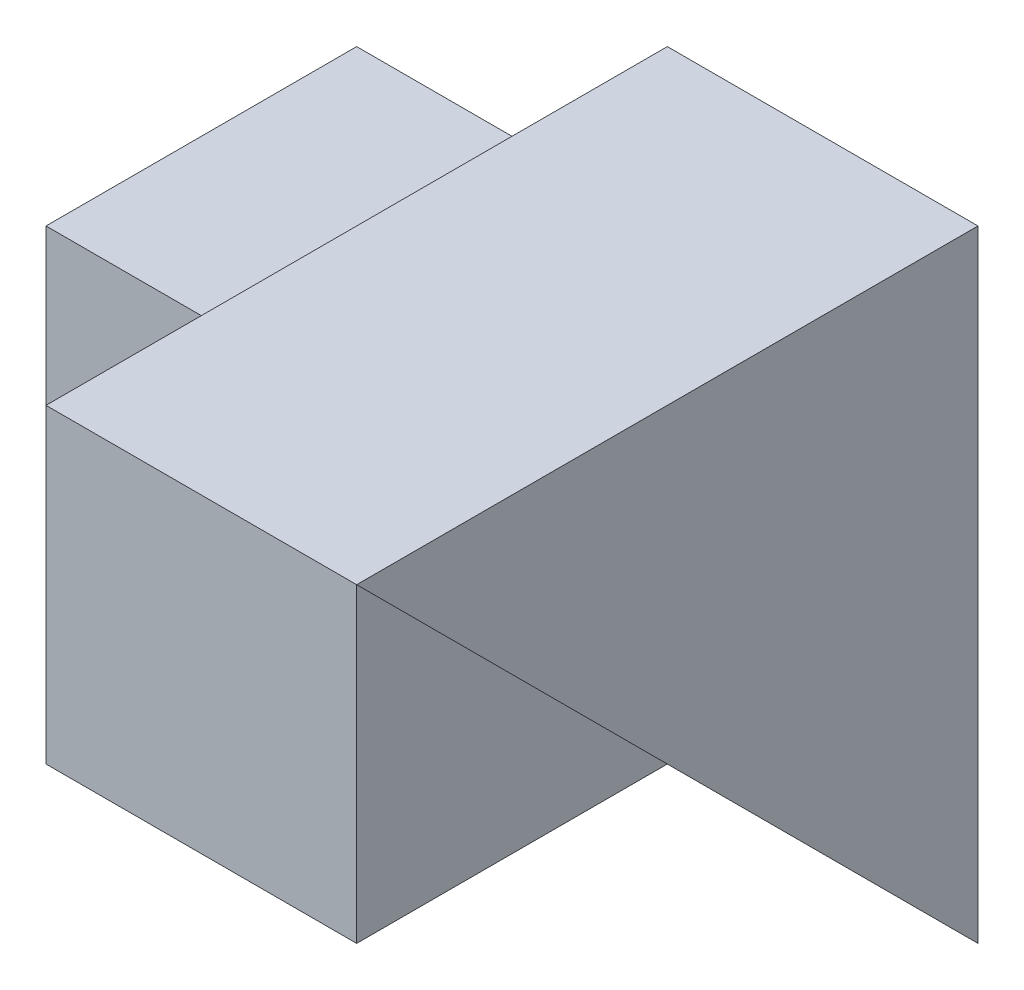
ISO-10303-21;
HEADER;
FILE_DESCRIPTION(('STEP AP214'),'2;1');
FILE_NAME('part.step','',(''),(''),'','','');
FILE_SCHEMA(('AUTOMOTIVE_DESIGN { 1 0 10303 214 1 1 1 1 }'));
ENDSEC;
DATA;
#1=APPLICATION_CONTEXT('core data for automotive mechanical design processes');
#2=APPLICATION_PROTOCOL_DEFINITION('international standard','automotive_design',2000,#1);
#3=PRODUCT_CONTEXT('',#1,'mechanical');
#4=PRODUCT('Part','Part','',(#3));
#5=PRODUCT_RELATED_PRODUCT_CATEGORY('part','',(#4));
#6=PRODUCT_DEFINITION_FORMATION('','',#4);
#7=PRODUCT_DEFINITION_CONTEXT('part definition',#1,'design');
#8=PRODUCT_DEFINITION('design','',#6,#7);
#9=PRODUCT_DEFINITION_SHAPE('','',#8);
#10=(LENGTH_UNIT() NAMED_UNIT(*) SI_UNIT(.MILLI.,.METRE.));
#11=(NAMED_UNIT(*) PLANE_ANGLE_UNIT() SI_UNIT($,.RADIAN.));
#12=(NAMED_UNIT(*) SI_UNIT($,.STERADIAN.) SOLID_ANGLE_UNIT());
#13=UNCERTAINTY_MEASURE_WITH_UNIT(LENGTH_MEASURE(1.E-05),#10,'distance_accuracy_value','');
#14=(GEOMETRIC_REPRESENTATION_CONTEXT(3) GLOBAL_UNCERTAINTY_ASSIGNED_CONTEXT((#13)) GLOBAL_UNIT_ASSIGNED_CONTEXT((#10,
#11,#12)) REPRESENTATION_CONTEXT('',''));
#15=CARTESIAN_POINT('',(0.,0.,0.));
#16=DIRECTION('',(0.,0.,1.));
#17=DIRECTION('',(1.,0.,0.));
#18=AXIS2_PLACEMENT_3D('',#15,#16,#17);
#19=CARTESIAN_POINT('',(2.,0.,0.));
#20=DIRECTION('',(0.,1.,0.));
#21=DIRECTION('',(0.,0.,1.));
#22=AXIS2_PLACEMENT_3D('',#19,#20,#21);
#23=PLANE('',#22);
#24=DIRECTION('',(0.,0.,-1.));
#25=VECTOR('',#24,1.);
#26=CARTESIAN_POINT('',(0.,0.,0.));
#27=LINE('',#26,#25);
#28=CARTESIAN_POINT('',(0.,0.,-2.));
#29=VERTEX_POINT('',#28);
#30=CARTESIAN_POINT('',(0.,0.,-4.));
#31=VERTEX_POINT('',#30);
#32=EDGE_CURVE('E109',#29,#31,#27,.T.);
#33=ORIENTED_EDGE('',*,*,#32,.F.);
#34=DIRECTION('',(1.,0.,0.));
#35=VECTOR('',#34,1.);
#36=CARTESIAN_POINT('',(-2.,0.,-2.));
#37=LINE('',#36,#35);
#38=CARTESIAN_POINT('',(-2.,0.,-2.));
#39=VERTEX_POINT('',#38);
#40=EDGE_CURVE('E118',#39,#29,#37,.T.);
#41=ORIENTED_EDGE('',*,*,#40,.F.);
#42=DIRECTION('',(0.,0.,1.));
#43=VECTOR('',#42,1.);
#44=CARTESIAN_POINT('',(-2.,0.,-4.));
#45=LINE('',#44,#43);
#46=CARTESIAN_POINT('',(-2.,0.,-4.));
#47=VERTEX_POINT('',#46);
#48=EDGE_CURVE('E158',#47,#39,#45,.T.);
#49=ORIENTED_EDGE('',*,*,#48,.F.);
#50=DIRECTION('',(-1.,0.,0.));
#51=VECTOR('',#50,1.);
#52=CARTESIAN_POINT('',(2.,0.,-4.));
#53=LINE('',#52,#51);
#54=EDGE_CURVE('E42',#31,#47,#53,.T.);
#55=ORIENTED_EDGE('',*,*,#54,.F.);
#56=EDGE_LOOP('',(#33,#41,#49,#55));
#57=FACE_BOUND('',#56,.T.);
#58=ADVANCED_FACE('F33',(#57),#23,.F.);
#59=CARTESIAN_POINT('',(2.,0.,0.));
#60=DIRECTION('',(-1.,0.,0.));
#61=DIRECTION('',(0.,0.,1.));
#62=AXIS2_PLACEMENT_3D('',#59,#60,#61);
#63=PLANE('',#62);
#64=DIRECTION('',(0.,-0.707106781186548,-0.707106781186548));
#65=VECTOR('',#64,1.);
#66=CARTESIAN_POINT('',(2.,2.,-2.));
#67=LINE('',#66,#65);
#68=CARTESIAN_POINT('',(2.,4.,0.));
#69=VERTEX_POINT('',#68);
#70=CARTESIAN_POINT('',(2.,0.,-4.));
#71=VERTEX_POINT('',#70);
#72=EDGE_CURVE('E97',#69,#71,#67,.T.);
#73=ORIENTED_EDGE('',*,*,#72,.T.);
#74=DIRECTION('',(0.,1.,0.));
#75=VECTOR('',#74,1.);
#76=CARTESIAN_POINT('',(2.,0.,-4.));
#77=LINE('',#76,#75);
#78=CARTESIAN_POINT('',(2.,4.,-4.));
#79=VERTEX_POINT('',#78);
#80=EDGE_CURVE('E115',#71,#79,#77,.T.);
#81=ORIENTED_EDGE('',*,*,#80,.T.);
#82=DIRECTION('',(0.,0.,1.));
#83=VECTOR('',#82,1.);
#84=CARTESIAN_POINT('',(2.,4.,0.));
#85=LINE('',#84,#83);
#86=EDGE_CURVE('E103',#79,#69,#85,.T.);
#87=ORIENTED_EDGE('',*,*,#86,.T.);
#88=EDGE_LOOP('',(#73,#81,#87));
#89=FACE_BOUND('',#88,.T.);
#90=ADVANCED_FACE('F146',(#89),#63,.F.);
#91=CARTESIAN_POINT('',(0.,0.,0.));
#92=DIRECTION('',(-1.,0.,0.));
#93=DIRECTION('',(0.,0.,1.));
#94=AXIS2_PLACEMENT_3D('',#91,#92,#93);
#95=PLANE('',#94);
#96=DIRECTION('',(0.,1.,0.));
#97=VECTOR('',#96,1.);
#98=CARTESIAN_POINT('',(0.,0.,-2.));
#99=LINE('',#98,#97);
#100=CARTESIAN_POINT('',(0.,2.,-2.));
#101=VERTEX_POINT('',#100);
#102=CARTESIAN_POINT('',(0.,3.,-2.));
#103=VERTEX_POINT('',#102);
#104=EDGE_CURVE('E36',#101,#103,#99,.T.);
#105=ORIENTED_EDGE('',*,*,#104,.F.);
#106=DIRECTION('',(0.,-0.707106781186548,-0.707106781186548));
#107=VECTOR('',#106,1.);
#108=CARTESIAN_POINT('',(0.,2.,-2.));
#109=LINE('',#108,#107);
#110=CARTESIAN_POINT('',(0.,4.,0.));
#111=VERTEX_POINT('',#110);
#112=EDGE_CURVE('E50',#111,#101,#109,.T.);
#113=ORIENTED_EDGE('',*,*,#112,.F.);
#114=DIRECTION('',(0.,0.,1.));
#115=VECTOR('',#114,1.);
#116=CARTESIAN_POINT('',(0.,4.,0.));
#117=LINE('',#116,#115);
#118=CARTESIAN_POINT('',(0.,4.,-4.));
#119=VERTEX_POINT('',#118);
#120=EDGE_CURVE('E107',#119,#111,#117,.T.);
#121=ORIENTED_EDGE('',*,*,#120,.F.);
#122=DIRECTION('',(0.,1.,0.));
#123=VECTOR('',#122,1.);
#124=CARTESIAN_POINT('',(0.,0.,-4.));
#125=LINE('',#124,#123);
#126=CARTESIAN_POINT('',(0.,3.,-4.));
#127=VERTEX_POINT('',#126);
#128=EDGE_CURVE('E58',#127,#119,#125,.T.);
#129=ORIENTED_EDGE('',*,*,#128,.F.);
#130=DIRECTION('',(0.,0.,-1.));
#131=VECTOR('',#130,1.);
#132=CARTESIAN_POINT('',(0.,3.,-4.));
#133=LINE('',#132,#131);
#134=EDGE_CURVE('E126',#103,#127,#133,.T.);
#135=ORIENTED_EDGE('',*,*,#134,.F.);
#136=EDGE_LOOP('',(#105,#113,#121,#129,#135));
#137=FACE_BOUND('',#136,.T.);
#138=ADVANCED_FACE('F106',(#137),#95,.T.);
#139=CARTESIAN_POINT('',(2.,0.,-4.));
#140=DIRECTION('',(0.,0.,1.));
#141=DIRECTION('',(1.,0.,0.));
#142=AXIS2_PLACEMENT_3D('',#139,#140,#141);
#143=PLANE('',#142);
#144=EDGE_CURVE('E11',#71,#31,#53,.T.);
#145=ORIENTED_EDGE('',*,*,#144,.T.);
#146=ORIENTED_EDGE('',*,*,#54,.T.);
#147=DIRECTION('',(0.,-1.,0.));
#148=VECTOR('',#147,1.);
#149=CARTESIAN_POINT('',(-2.,0.,-4.));
#150=LINE('',#149,#148);
#151=CARTESIAN_POINT('',(-2.,3.,-4.));
#152=VERTEX_POINT('',#151);
#153=EDGE_CURVE('E137',#152,#47,#150,.T.);
#154=ORIENTED_EDGE('',*,*,#153,.F.);
#155=DIRECTION('',(1.,0.,0.));
#156=VECTOR('',#155,1.);
#157=CARTESIAN_POINT('',(-2.,3.,-4.));
#158=LINE('',#157,#156);
#159=EDGE_CURVE('E138',#152,#127,#158,.T.);
#160=ORIENTED_EDGE('',*,*,#159,.T.);
#161=ORIENTED_EDGE('',*,*,#128,.T.);
#162=DIRECTION('',(-1.,0.,0.));
#163=VECTOR('',#162,1.);
#164=CARTESIAN_POINT('',(2.,4.,-4.));
#165=LINE('',#164,#163);
#166=EDGE_CURVE('E102',#79,#119,#165,.T.);
#167=ORIENTED_EDGE('',*,*,#166,.F.);
#168=ORIENTED_EDGE('',*,*,#80,.F.);
#169=EDGE_LOOP('',(#145,#146,#154,#160,#161,#167,#168));
#170=FACE_BOUND('',#169,.T.);
#171=ADVANCED_FACE('F149',(#170),#143,.F.);
#172=CARTESIAN_POINT('',(2.,4.,0.));
#173=DIRECTION('',(0.,-1.,0.));
#174=DIRECTION('',(0.,0.,-1.));
#175=AXIS2_PLACEMENT_3D('',#172,#173,#174);
#176=PLANE('',#175);
#177=ORIENTED_EDGE('',*,*,#120,.T.);
#178=DIRECTION('',(-1.,0.,0.));
#179=VECTOR('',#178,1.);
#180=CARTESIAN_POINT('',(2.,4.,0.));
#181=LINE('',#180,#179);
#182=EDGE_CURVE('E94',#69,#111,#181,.T.);
#183=ORIENTED_EDGE('',*,*,#182,.F.);
#184=ORIENTED_EDGE('',*,*,#86,.F.);
#185=ORIENTED_EDGE('',*,*,#166,.T.);
#186=EDGE_LOOP('',(#177,#183,#184,#185));
#187=FACE_BOUND('',#186,.T.);
#188=ADVANCED_FACE('F113',(#187),#176,.F.);
#189=CARTESIAN_POINT('',(-2.,0.,-2.));
#190=DIRECTION('',(0.,0.,-1.));
#191=DIRECTION('',(-1.,0.,0.));
#192=AXIS2_PLACEMENT_3D('',#189,#190,#191);
#193=PLANE('',#192);
#194=EDGE_CURVE('E125',#29,#101,#99,.T.);
#195=ORIENTED_EDGE('',*,*,#194,.T.);
#196=ORIENTED_EDGE('',*,*,#104,.T.);
#197=DIRECTION('',(1.,0.,0.));
#198=VECTOR('',#197,1.);
#199=CARTESIAN_POINT('',(-2.,3.,-2.));
#200=LINE('',#199,#198);
#201=CARTESIAN_POINT('',(-2.,3.,-2.));
#202=VERTEX_POINT('',#201);
#203=EDGE_CURVE('E132',#202,#103,#200,.T.);
#204=ORIENTED_EDGE('',*,*,#203,.F.);
#205=DIRECTION('',(0.,1.,0.));
#206=VECTOR('',#205,1.);
#207=CARTESIAN_POINT('',(-2.,0.,-2.));
#208=LINE('',#207,#206);
#209=EDGE_CURVE('E156',#39,#202,#208,.T.);
#210=ORIENTED_EDGE('',*,*,#209,.F.);
#211=ORIENTED_EDGE('',*,*,#40,.T.);
#212=EDGE_LOOP('',(#195,#196,#204,#210,#211));
#213=FACE_BOUND('',#212,.T.);
#214=ADVANCED_FACE('F183',(#213),#193,.F.);
#215=CARTESIAN_POINT('',(-2.,3.,-4.));
#216=DIRECTION('',(0.,-1.,0.));
#217=DIRECTION('',(0.,0.,-1.));
#218=AXIS2_PLACEMENT_3D('',#215,#216,#217);
#219=PLANE('',#218);
#220=ORIENTED_EDGE('',*,*,#134,.T.);
#221=ORIENTED_EDGE('',*,*,#159,.F.);
#222=DIRECTION('',(0.,0.,-1.));
#223=VECTOR('',#222,1.);
#224=CARTESIAN_POINT('',(-2.,3.,-4.));
#225=LINE('',#224,#223);
#226=EDGE_CURVE('E142',#202,#152,#225,.T.);
#227=ORIENTED_EDGE('',*,*,#226,.F.);
#228=ORIENTED_EDGE('',*,*,#203,.T.);
#229=EDGE_LOOP('',(#220,#221,#227,#228));
#230=FACE_BOUND('',#229,.T.);
#231=ADVANCED_FACE('F176',(#230),#219,.F.);
#232=CARTESIAN_POINT('',(-2.,0.,0.));
#233=DIRECTION('',(1.,0.,0.));
#234=DIRECTION('',(0.,0.,-1.));
#235=AXIS2_PLACEMENT_3D('',#232,#233,#234);
#236=PLANE('',#235);
#237=ORIENTED_EDGE('',*,*,#153,.T.);
#238=ORIENTED_EDGE('',*,*,#48,.T.);
#239=ORIENTED_EDGE('',*,*,#209,.T.);
#240=ORIENTED_EDGE('',*,*,#226,.T.);
#241=EDGE_LOOP('',(#237,#238,#239,#240));
#242=FACE_BOUND('',#241,.T.);
#243=ADVANCED_FACE('F173',(#242),#236,.F.);
#244=CARTESIAN_POINT('',(0.,0.,0.));
#245=DIRECTION('',(1.,0.,0.));
#246=DIRECTION('',(0.,0.,-1.));
#247=AXIS2_PLACEMENT_3D('',#244,#245,#246);
#248=PLANE('',#247);
#249=ORIENTED_EDGE('',*,*,#194,.F.);
#250=ORIENTED_EDGE('',*,*,#32,.T.);
#251=EDGE_CURVE('E110',#101,#31,#109,.T.);
#252=ORIENTED_EDGE('',*,*,#251,.F.);
#253=EDGE_LOOP('',(#249,#250,#252));
#254=FACE_BOUND('',#253,.T.);
#255=ADVANCED_FACE('F175',(#254),#248,.T.);
#256=CARTESIAN_POINT('',(0.,2.,-2.));
#257=DIRECTION('',(0.,-0.707106781186547,0.707106781186547));
#258=DIRECTION('',(0.,-0.707106781186548,-0.707106781186548));
#259=AXIS2_PLACEMENT_3D('',#256,#257,#258);
#260=PLANE('',#259);
#261=ORIENTED_EDGE('',*,*,#72,.F.);
#262=ORIENTED_EDGE('',*,*,#182,.T.);
#263=ORIENTED_EDGE('',*,*,#112,.T.);
#264=ORIENTED_EDGE('',*,*,#251,.T.);
#265=ORIENTED_EDGE('',*,*,#144,.F.);
#266=EDGE_LOOP('',(#261,#262,#263,#264,#265));
#267=FACE_BOUND('',#266,.T.);
#268=ADVANCED_FACE('F95',(#267),#260,.T.);
#269=CLOSED_SHELL('',(#58,#90,#138,#171,#188,#214,#231,#243,#255,#268));
#270=MANIFOLD_SOLID_BREP('B2',#269);
#271=ADVANCED_BREP_SHAPE_REPRESENTATION('',(#18,#270),#14);
#272=SHAPE_DEFINITION_REPRESENTATION(#9,#271);
ENDSEC;
END-ISO-10303-21;
